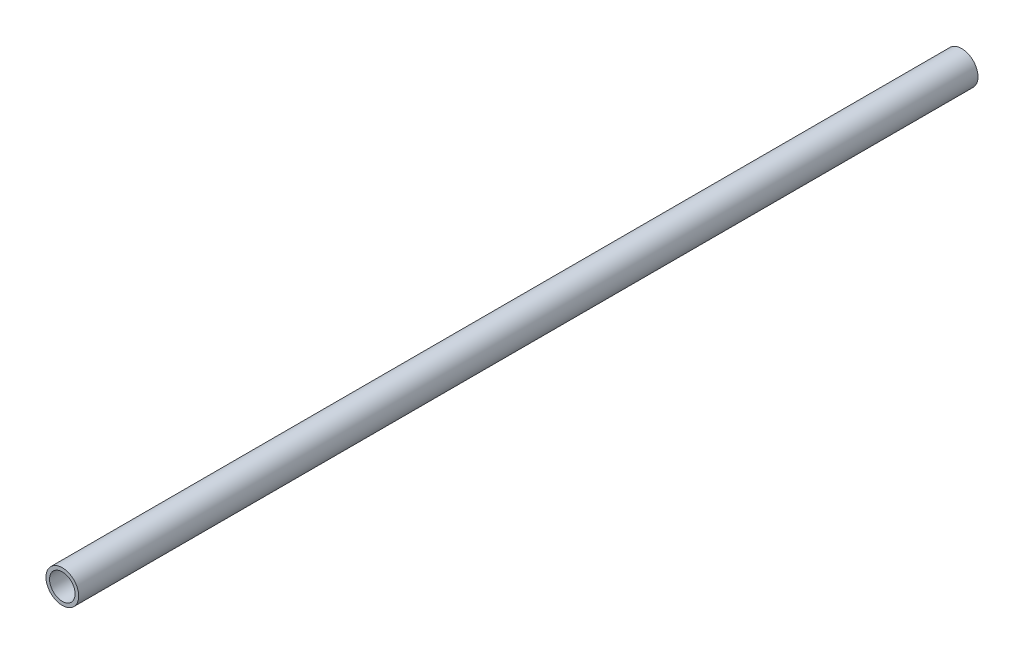
ISO-10303-21;
HEADER;
FILE_DESCRIPTION(('STEP AP214'),'2;1');
FILE_NAME('part.step','',(''),(''),'','','');
FILE_SCHEMA(('AUTOMOTIVE_DESIGN { 1 0 10303 214 1 1 1 1 }'));
ENDSEC;
DATA;
#1=APPLICATION_CONTEXT('core data for automotive mechanical design processes');
#2=APPLICATION_PROTOCOL_DEFINITION('international standard','automotive_design',2000,#1);
#3=PRODUCT_CONTEXT('',#1,'mechanical');
#4=PRODUCT('Part','Part','',(#3));
#5=PRODUCT_RELATED_PRODUCT_CATEGORY('part','',(#4));
#6=PRODUCT_DEFINITION_FORMATION('','',#4);
#7=PRODUCT_DEFINITION_CONTEXT('part definition',#1,'design');
#8=PRODUCT_DEFINITION('design','',#6,#7);
#9=PRODUCT_DEFINITION_SHAPE('','',#8);
#10=(LENGTH_UNIT() NAMED_UNIT(*) SI_UNIT(.MILLI.,.METRE.));
#11=(NAMED_UNIT(*) PLANE_ANGLE_UNIT() SI_UNIT($,.RADIAN.));
#12=(NAMED_UNIT(*) SI_UNIT($,.STERADIAN.) SOLID_ANGLE_UNIT());
#13=UNCERTAINTY_MEASURE_WITH_UNIT(LENGTH_MEASURE(1.E-05),#10,'distance_accuracy_value','');
#14=(GEOMETRIC_REPRESENTATION_CONTEXT(3) GLOBAL_UNCERTAINTY_ASSIGNED_CONTEXT((#13)) GLOBAL_UNIT_ASSIGNED_CONTEXT((#10,
#11,#12)) REPRESENTATION_CONTEXT('',''));
#15=CARTESIAN_POINT('',(0.,0.,0.));
#16=DIRECTION('',(0.,0.,1.));
#17=DIRECTION('',(1.,0.,0.));
#18=AXIS2_PLACEMENT_3D('',#15,#16,#17);
#19=CARTESIAN_POINT('',(0.,0.,220.));
#20=DIRECTION('',(0.,0.,-1.));
#21=DIRECTION('',(-1.,0.,0.));
#22=AXIS2_PLACEMENT_3D('',#19,#20,#21);
#23=CYLINDRICAL_SURFACE('',#22,4.);
#24=CARTESIAN_POINT('',(0.,0.,220.));
#25=DIRECTION('',(0.,0.,1.));
#26=DIRECTION('',(1.,0.,0.));
#27=AXIS2_PLACEMENT_3D('',#24,#25,#26);
#28=CIRCLE('',#27,4.);
#29=CARTESIAN_POINT('',(4.,0.,220.));
#30=VERTEX_POINT('',#29);
#31=EDGE_CURVE('E10',#30,#30,#28,.T.);
#32=ORIENTED_EDGE('',*,*,#31,.F.);
#33=EDGE_LOOP('',(#32));
#34=FACE_BOUND('',#33,.T.);
#35=CARTESIAN_POINT('',(0.,0.,0.));
#36=DIRECTION('',(0.,0.,1.));
#37=DIRECTION('',(1.,0.,0.));
#38=AXIS2_PLACEMENT_3D('',#35,#36,#37);
#39=CIRCLE('',#38,4.);
#40=CARTESIAN_POINT('',(4.,0.,0.));
#41=VERTEX_POINT('',#40);
#42=EDGE_CURVE('E41',#41,#41,#39,.T.);
#43=ORIENTED_EDGE('',*,*,#42,.T.);
#44=EDGE_LOOP('',(#43));
#45=FACE_BOUND('',#44,.T.);
#46=ADVANCED_FACE('F38',(#34,#45),#23,.T.);
#47=CARTESIAN_POINT('',(0.,0.,220.));
#48=DIRECTION('',(0.,0.,1.));
#49=DIRECTION('',(1.,0.,0.));
#50=AXIS2_PLACEMENT_3D('',#47,#48,#49);
#51=PLANE('',#50);
#52=CARTESIAN_POINT('',(0.,0.,220.));
#53=DIRECTION('',(0.,0.,1.));
#54=DIRECTION('',(1.,0.,0.));
#55=AXIS2_PLACEMENT_3D('',#52,#53,#54);
#56=CIRCLE('',#55,3.125);
#57=CARTESIAN_POINT('',(3.125,0.,220.));
#58=VERTEX_POINT('',#57);
#59=EDGE_CURVE('E54',#58,#58,#56,.T.);
#60=ORIENTED_EDGE('',*,*,#59,.F.);
#61=EDGE_LOOP('',(#60));
#62=FACE_BOUND('',#61,.T.);
#63=ORIENTED_EDGE('',*,*,#31,.T.);
#64=EDGE_LOOP('',(#63));
#65=FACE_BOUND('',#64,.T.);
#66=ADVANCED_FACE('F80',(#62,#65),#51,.T.);
#67=CARTESIAN_POINT('',(0.,0.,0.));
#68=DIRECTION('',(0.,0.,1.));
#69=DIRECTION('',(1.,0.,0.));
#70=AXIS2_PLACEMENT_3D('',#67,#68,#69);
#71=PLANE('',#70);
#72=CARTESIAN_POINT('',(0.,0.,0.));
#73=DIRECTION('',(0.,0.,1.));
#74=DIRECTION('',(1.,0.,0.));
#75=AXIS2_PLACEMENT_3D('',#72,#73,#74);
#76=CIRCLE('',#75,3.125);
#77=CARTESIAN_POINT('',(3.125,0.,0.));
#78=VERTEX_POINT('',#77);
#79=EDGE_CURVE('E61',#78,#78,#76,.T.);
#80=ORIENTED_EDGE('',*,*,#79,.T.);
#81=EDGE_LOOP('',(#80));
#82=FACE_BOUND('',#81,.T.);
#83=ORIENTED_EDGE('',*,*,#42,.F.);
#84=EDGE_LOOP('',(#83));
#85=FACE_BOUND('',#84,.T.);
#86=ADVANCED_FACE('F85',(#82,#85),#71,.F.);
#87=CARTESIAN_POINT('',(0.,0.,213.5));
#88=DIRECTION('',(0.,0.,1.));
#89=DIRECTION('',(1.,0.,0.));
#90=AXIS2_PLACEMENT_3D('',#87,#88,#89);
#91=CYLINDRICAL_SURFACE('',#90,3.125);
#92=CARTESIAN_POINT('',(0.,0.,213.5));
#93=DIRECTION('',(0.,0.,1.));
#94=DIRECTION('',(1.,0.,0.));
#95=AXIS2_PLACEMENT_3D('',#92,#93,#94);
#96=CIRCLE('',#95,3.125);
#97=CARTESIAN_POINT('',(3.125,0.,213.5));
#98=VERTEX_POINT('',#97);
#99=EDGE_CURVE('E52',#98,#98,#96,.T.);
#100=ORIENTED_EDGE('',*,*,#99,.F.);
#101=EDGE_LOOP('',(#100));
#102=FACE_BOUND('',#101,.T.);
#103=ORIENTED_EDGE('',*,*,#59,.T.);
#104=EDGE_LOOP('',(#103));
#105=FACE_BOUND('',#104,.T.);
#106=ADVANCED_FACE('F92',(#102,#105),#91,.F.);
#107=CARTESIAN_POINT('',(0.,0.,213.5));
#108=DIRECTION('',(0.,0.,1.));
#109=DIRECTION('',(1.,0.,0.));
#110=AXIS2_PLACEMENT_3D('',#107,#108,#109);
#111=PLANE('',#110);
#112=ORIENTED_EDGE('',*,*,#99,.T.);
#113=EDGE_LOOP('',(#112));
#114=FACE_BOUND('',#113,.T.);
#115=ADVANCED_FACE('F77',(#114),#111,.T.);
#116=CARTESIAN_POINT('',(0.,0.,6.5));
#117=DIRECTION('',(0.,0.,-1.));
#118=DIRECTION('',(-1.,0.,0.));
#119=AXIS2_PLACEMENT_3D('',#116,#117,#118);
#120=CYLINDRICAL_SURFACE('',#119,3.125);
#121=CARTESIAN_POINT('',(0.,0.,6.5));
#122=DIRECTION('',(0.,0.,1.));
#123=DIRECTION('',(1.,0.,0.));
#124=AXIS2_PLACEMENT_3D('',#121,#122,#123);
#125=CIRCLE('',#124,3.125);
#126=CARTESIAN_POINT('',(3.125,0.,6.5));
#127=VERTEX_POINT('',#126);
#128=EDGE_CURVE('E57',#127,#127,#125,.T.);
#129=ORIENTED_EDGE('',*,*,#128,.T.);
#130=EDGE_LOOP('',(#129));
#131=FACE_BOUND('',#130,.T.);
#132=ORIENTED_EDGE('',*,*,#79,.F.);
#133=EDGE_LOOP('',(#132));
#134=FACE_BOUND('',#133,.T.);
#135=ADVANCED_FACE('F68',(#131,#134),#120,.F.);
#136=CARTESIAN_POINT('',(0.,0.,6.5));
#137=DIRECTION('',(0.,0.,-1.));
#138=DIRECTION('',(1.,0.,0.));
#139=AXIS2_PLACEMENT_3D('',#136,#137,#138);
#140=PLANE('',#139);
#141=ORIENTED_EDGE('',*,*,#128,.F.);
#142=EDGE_LOOP('',(#141));
#143=FACE_BOUND('',#142,.T.);
#144=ADVANCED_FACE('F71',(#143),#140,.T.);
#145=CLOSED_SHELL('',(#46,#66,#86,#106,#115,#135,#144));
#146=MANIFOLD_SOLID_BREP('B2',#145);
#147=ADVANCED_BREP_SHAPE_REPRESENTATION('',(#18,#146),#14);
#148=SHAPE_DEFINITION_REPRESENTATION(#9,#147);
ENDSEC;
END-ISO-10303-21;
